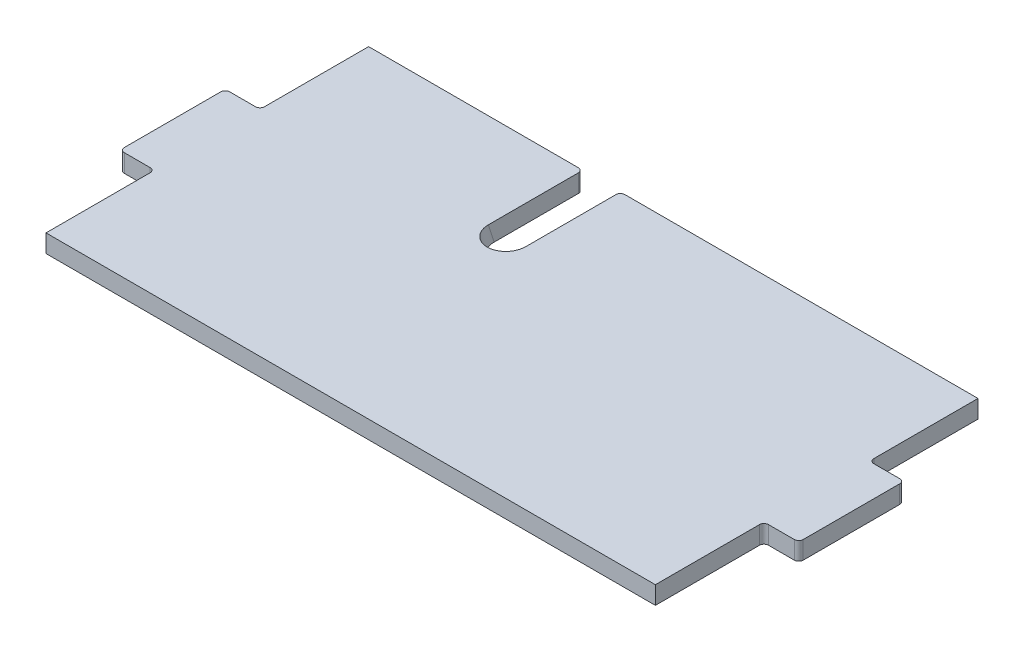
ISO-10303-21;
HEADER;
FILE_DESCRIPTION(('STEP AP214'),'2;1');
FILE_NAME('part.step','',(''),(''),'','','');
FILE_SCHEMA(('AUTOMOTIVE_DESIGN { 1 0 10303 214 1 1 1 1 }'));
ENDSEC;
DATA;
#1=APPLICATION_CONTEXT('core data for automotive mechanical design processes');
#2=APPLICATION_PROTOCOL_DEFINITION('international standard','automotive_design',2000,#1);
#3=PRODUCT_CONTEXT('',#1,'mechanical');
#4=PRODUCT('Part','Part','',(#3));
#5=PRODUCT_RELATED_PRODUCT_CATEGORY('part','',(#4));
#6=PRODUCT_DEFINITION_FORMATION('','',#4);
#7=PRODUCT_DEFINITION_CONTEXT('part definition',#1,'design');
#8=PRODUCT_DEFINITION('design','',#6,#7);
#9=PRODUCT_DEFINITION_SHAPE('','',#8);
#10=(LENGTH_UNIT() NAMED_UNIT(*) SI_UNIT(.MILLI.,.METRE.));
#11=(NAMED_UNIT(*) PLANE_ANGLE_UNIT() SI_UNIT($,.RADIAN.));
#12=(NAMED_UNIT(*) SI_UNIT($,.STERADIAN.) SOLID_ANGLE_UNIT());
#13=UNCERTAINTY_MEASURE_WITH_UNIT(LENGTH_MEASURE(1.E-05),#10,'distance_accuracy_value','');
#14=(GEOMETRIC_REPRESENTATION_CONTEXT(3) GLOBAL_UNCERTAINTY_ASSIGNED_CONTEXT((#13)) GLOBAL_UNIT_ASSIGNED_CONTEXT((#10,
#11,#12)) REPRESENTATION_CONTEXT('',''));
#15=CARTESIAN_POINT('',(0.,0.,0.));
#16=DIRECTION('',(0.,0.,1.));
#17=DIRECTION('',(1.,0.,0.));
#18=AXIS2_PLACEMENT_3D('',#15,#16,#17);
#19=CARTESIAN_POINT('',(-215.9,6.35,-88.9));
#20=DIRECTION('',(0.,0.,1.));
#21=DIRECTION('',(1.,0.,0.));
#22=AXIS2_PLACEMENT_3D('',#19,#20,#21);
#23=PLANE('',#22);
#24=DIRECTION('',(-1.,0.,0.));
#25=VECTOR('',#24,1.);
#26=CARTESIAN_POINT('',(-215.9,6.35,-88.9));
#27=LINE('',#26,#25);
#28=CARTESIAN_POINT('',(-67.3100000000009,6.35,-88.9));
#29=VERTEX_POINT('',#28);
#30=CARTESIAN_POINT('',(-215.9,6.35,-88.9));
#31=VERTEX_POINT('',#30);
#32=EDGE_CURVE('E262',#29,#31,#27,.T.);
#33=ORIENTED_EDGE('',*,*,#32,.F.);
#34=DIRECTION('',(0.,1.,0.));
#35=VECTOR('',#34,1.);
#36=CARTESIAN_POINT('',(-67.3100000000009,6.35,-88.9));
#37=LINE('',#36,#35);
#38=CARTESIAN_POINT('',(-67.3100000000009,-6.35,-88.9));
#39=VERTEX_POINT('',#38);
#40=EDGE_CURVE('E226',#29,#39,#37,.F.);
#41=ORIENTED_EDGE('',*,*,#40,.T.);
#42=DIRECTION('',(-1.,0.,0.));
#43=VECTOR('',#42,1.);
#44=CARTESIAN_POINT('',(-215.9,-6.35,-88.9));
#45=LINE('',#44,#43);
#46=CARTESIAN_POINT('',(-215.9,-6.35,-88.9));
#47=VERTEX_POINT('',#46);
#48=EDGE_CURVE('E220',#39,#47,#45,.T.);
#49=ORIENTED_EDGE('',*,*,#48,.T.);
#50=DIRECTION('',(0.,-1.,0.));
#51=VECTOR('',#50,1.);
#52=CARTESIAN_POINT('',(-215.9,6.35,-88.9));
#53=LINE('',#52,#51);
#54=EDGE_CURVE('E223',#31,#47,#53,.T.);
#55=ORIENTED_EDGE('',*,*,#54,.F.);
#56=EDGE_LOOP('',(#33,#41,#49,#55));
#57=FACE_BOUND('',#56,.T.);
#58=ADVANCED_FACE('F44',(#57),#23,.F.);
#59=CARTESIAN_POINT('',(-50.7999999999984,-226.171808135511,-98.2610939856412));
#60=DIRECTION('',(0.,0.950122861158082,0.31187585463575));
#61=DIRECTION('',(0.,0.31187585463575,-0.950122861158083));
#62=AXIS2_PLACEMENT_3D('',#59,#60,#61);
#63=CYLINDRICAL_SURFACE('',#62,13.3350000000001);
#64=CARTESIAN_POINT('',(-50.7999999999983,-6.34999999999999,-26.1050422974673));
#65=DIRECTION('',(0.,1.,0.));
#66=DIRECTION('',(0.,0.,1.));
#67=AXIS2_PLACEMENT_3D('',#64,#65,#66);
#68=ELLIPSE('',#67,14.0350269898215,13.3350000000001);
#69=CARTESIAN_POINT('',(-37.4650000000006,-6.34999999999999,-26.1050422974673));
#70=VERTEX_POINT('',#69);
#71=CARTESIAN_POINT('',(-64.1350000000009,-6.34999999999999,-26.1050422974673));
#72=VERTEX_POINT('',#71);
#73=EDGE_CURVE('E261',#70,#72,#68,.F.);
#74=ORIENTED_EDGE('',*,*,#73,.T.);
#75=DIRECTION('',(0.,0.950122861158082,0.31187585463575));
#76=VECTOR('',#75,1.);
#77=CARTESIAN_POINT('',(-64.1349999999985,-226.171808135511,-98.2610939856412));
#78=LINE('',#77,#76);
#79=CARTESIAN_POINT('',(-64.1350000000009,6.34999999999999,-21.936293690528));
#80=VERTEX_POINT('',#79);
#81=EDGE_CURVE('E249',#80,#72,#78,.F.);
#82=ORIENTED_EDGE('',*,*,#81,.F.);
#83=CARTESIAN_POINT('',(-50.7999999999983,6.34999999999999,-21.936293690528));
#84=DIRECTION('',(0.,1.,0.));
#85=DIRECTION('',(0.,0.,1.));
#86=AXIS2_PLACEMENT_3D('',#83,#84,#85);
#87=ELLIPSE('',#86,14.0350269898215,13.3350000000001);
#88=CARTESIAN_POINT('',(-37.4650000000007,6.35,-21.9362936905279));
#89=VERTEX_POINT('',#88);
#90=EDGE_CURVE('E282',#89,#80,#87,.F.);
#91=ORIENTED_EDGE('',*,*,#90,.F.);
#92=DIRECTION('',(0.,0.950122861158082,0.31187585463575));
#93=VECTOR('',#92,1.);
#94=CARTESIAN_POINT('',(-37.4649999999983,-226.171808135511,-98.2610939856413));
#95=LINE('',#94,#93);
#96=EDGE_CURVE('E327',#89,#70,#95,.F.);
#97=ORIENTED_EDGE('',*,*,#96,.T.);
#98=EDGE_LOOP('',(#74,#82,#91,#97));
#99=FACE_BOUND('',#98,.T.);
#100=ADVANCED_FACE('F502',(#99),#63,.F.);
#101=CARTESIAN_POINT('',(-215.9,6.35,-88.9));
#102=DIRECTION('',(1.,0.,0.));
#103=DIRECTION('',(0.,0.,-1.));
#104=AXIS2_PLACEMENT_3D('',#101,#102,#103);
#105=PLANE('',#104);
#106=DIRECTION('',(0.,0.,1.));
#107=VECTOR('',#106,1.);
#108=CARTESIAN_POINT('',(-215.9,-6.35,-88.9));
#109=LINE('',#108,#107);
#110=CARTESIAN_POINT('',(-215.9,-6.35,-15.113));
#111=VERTEX_POINT('',#110);
#112=EDGE_CURVE('E237',#47,#111,#109,.T.);
#113=ORIENTED_EDGE('',*,*,#112,.T.);
#114=DIRECTION('',(0.,-1.,0.));
#115=VECTOR('',#114,1.);
#116=CARTESIAN_POINT('',(-215.9,6.35,-15.113));
#117=LINE('',#116,#115);
#118=CARTESIAN_POINT('',(-215.9,6.35,-15.113));
#119=VERTEX_POINT('',#118);
#120=EDGE_CURVE('E359',#111,#119,#117,.F.);
#121=ORIENTED_EDGE('',*,*,#120,.T.);
#122=DIRECTION('',(0.,0.,1.));
#123=VECTOR('',#122,1.);
#124=CARTESIAN_POINT('',(-215.9,6.35,-88.9));
#125=LINE('',#124,#123);
#126=EDGE_CURVE('E240',#31,#119,#125,.T.);
#127=ORIENTED_EDGE('',*,*,#126,.F.);
#128=ORIENTED_EDGE('',*,*,#54,.T.);
#129=EDGE_LOOP('',(#113,#121,#127,#128));
#130=FACE_BOUND('',#129,.T.);
#131=ADVANCED_FACE('F236',(#130),#105,.F.);
#132=CARTESIAN_POINT('',(-241.3,6.35,-11.938));
#133=DIRECTION('',(0.,0.,1.));
#134=DIRECTION('',(1.,0.,0.));
#135=AXIS2_PLACEMENT_3D('',#132,#133,#134);
#136=PLANE('',#135);
#137=DIRECTION('',(-1.,0.,0.));
#138=VECTOR('',#137,1.);
#139=CARTESIAN_POINT('',(-241.3,6.35,-11.938));
#140=LINE('',#139,#138);
#141=CARTESIAN_POINT('',(-219.075,6.35,-11.938));
#142=VERTEX_POINT('',#141);
#143=CARTESIAN_POINT('',(-237.363,6.35,-11.938));
#144=VERTEX_POINT('',#143);
#145=EDGE_CURVE('E281',#142,#144,#140,.T.);
#146=ORIENTED_EDGE('',*,*,#145,.F.);
#147=DIRECTION('',(0.,-1.,0.));
#148=VECTOR('',#147,1.);
#149=CARTESIAN_POINT('',(-219.075,-6.35,-11.938));
#150=LINE('',#149,#148);
#151=CARTESIAN_POINT('',(-219.075,-6.35,-11.938));
#152=VERTEX_POINT('',#151);
#153=EDGE_CURVE('E355',#142,#152,#150,.T.);
#154=ORIENTED_EDGE('',*,*,#153,.T.);
#155=DIRECTION('',(-1.,0.,0.));
#156=VECTOR('',#155,1.);
#157=CARTESIAN_POINT('',(-241.3,-6.35,-11.938));
#158=LINE('',#157,#156);
#159=CARTESIAN_POINT('',(-237.363,-6.35,-11.938));
#160=VERTEX_POINT('',#159);
#161=EDGE_CURVE('E242',#152,#160,#158,.T.);
#162=ORIENTED_EDGE('',*,*,#161,.T.);
#163=DIRECTION('',(0.,-1.,0.));
#164=VECTOR('',#163,1.);
#165=CARTESIAN_POINT('',(-237.363,6.35,-11.938));
#166=LINE('',#165,#164);
#167=EDGE_CURVE('E339',#160,#144,#166,.F.);
#168=ORIENTED_EDGE('',*,*,#167,.T.);
#169=EDGE_LOOP('',(#146,#154,#162,#168));
#170=FACE_BOUND('',#169,.T.);
#171=ADVANCED_FACE('F547',(#170),#136,.F.);
#172=CARTESIAN_POINT('',(-240.538,6.35,-12.7));
#173=DIRECTION('',(1.,0.,0.));
#174=DIRECTION('',(0.,0.,-1.));
#175=AXIS2_PLACEMENT_3D('',#172,#173,#174);
#176=PLANE('',#175);
#177=DIRECTION('',(0.,0.,1.));
#178=VECTOR('',#177,1.);
#179=CARTESIAN_POINT('',(-240.538,6.35,-12.7));
#180=LINE('',#179,#178);
#181=CARTESIAN_POINT('',(-240.538,6.35,-8.76299999999999));
#182=VERTEX_POINT('',#181);
#183=CARTESIAN_POINT('',(-240.538,6.35,59.563));
#184=VERTEX_POINT('',#183);
#185=EDGE_CURVE('E297',#182,#184,#180,.T.);
#186=ORIENTED_EDGE('',*,*,#185,.F.);
#187=DIRECTION('',(0.,-1.,0.));
#188=VECTOR('',#187,1.);
#189=CARTESIAN_POINT('',(-240.538,6.35,-8.76299999999999));
#190=LINE('',#189,#188);
#191=CARTESIAN_POINT('',(-240.538,-6.35,-8.76299999999999));
#192=VERTEX_POINT('',#191);
#193=EDGE_CURVE('E365',#182,#192,#190,.T.);
#194=ORIENTED_EDGE('',*,*,#193,.T.);
#195=DIRECTION('',(0.,0.,1.));
#196=VECTOR('',#195,1.);
#197=CARTESIAN_POINT('',(-240.538,-6.35,-12.7));
#198=LINE('',#197,#196);
#199=CARTESIAN_POINT('',(-240.538,-6.35,59.563));
#200=VERTEX_POINT('',#199);
#201=EDGE_CURVE('E287',#192,#200,#198,.T.);
#202=ORIENTED_EDGE('',*,*,#201,.T.);
#203=DIRECTION('',(0.,-1.,0.));
#204=VECTOR('',#203,1.);
#205=CARTESIAN_POINT('',(-240.538,6.35,59.563));
#206=LINE('',#205,#204);
#207=EDGE_CURVE('E362',#200,#184,#206,.F.);
#208=ORIENTED_EDGE('',*,*,#207,.T.);
#209=EDGE_LOOP('',(#186,#194,#202,#208));
#210=FACE_BOUND('',#209,.T.);
#211=ADVANCED_FACE('F551',(#210),#176,.F.);
#212=CARTESIAN_POINT('',(-215.9,6.35,62.738));
#213=DIRECTION('',(0.,0.,-1.));
#214=DIRECTION('',(-1.,0.,0.));
#215=AXIS2_PLACEMENT_3D('',#212,#213,#214);
#216=PLANE('',#215);
#217=DIRECTION('',(1.,0.,0.));
#218=VECTOR('',#217,1.);
#219=CARTESIAN_POINT('',(-215.9,6.35,62.738));
#220=LINE('',#219,#218);
#221=CARTESIAN_POINT('',(-237.363,6.35,62.738));
#222=VERTEX_POINT('',#221);
#223=CARTESIAN_POINT('',(-219.075,6.35,62.738));
#224=VERTEX_POINT('',#223);
#225=EDGE_CURVE('E278',#222,#224,#220,.T.);
#226=ORIENTED_EDGE('',*,*,#225,.F.);
#227=DIRECTION('',(0.,-1.,0.));
#228=VECTOR('',#227,1.);
#229=CARTESIAN_POINT('',(-237.363,6.35,62.738));
#230=LINE('',#229,#228);
#231=CARTESIAN_POINT('',(-237.363,-6.35,62.738));
#232=VERTEX_POINT('',#231);
#233=EDGE_CURVE('E407',#222,#232,#230,.T.);
#234=ORIENTED_EDGE('',*,*,#233,.T.);
#235=DIRECTION('',(1.,0.,0.));
#236=VECTOR('',#235,1.);
#237=CARTESIAN_POINT('',(-215.9,-6.35,62.738));
#238=LINE('',#237,#236);
#239=CARTESIAN_POINT('',(-219.075,-6.35,62.738));
#240=VERTEX_POINT('',#239);
#241=EDGE_CURVE('E283',#232,#240,#238,.T.);
#242=ORIENTED_EDGE('',*,*,#241,.T.);
#243=DIRECTION('',(0.,-1.,0.));
#244=VECTOR('',#243,1.);
#245=CARTESIAN_POINT('',(-219.075,6.35,62.738));
#246=LINE('',#245,#244);
#247=EDGE_CURVE('E404',#240,#224,#246,.F.);
#248=ORIENTED_EDGE('',*,*,#247,.T.);
#249=EDGE_LOOP('',(#226,#234,#242,#248));
#250=FACE_BOUND('',#249,.T.);
#251=ADVANCED_FACE('F544',(#250),#216,.F.);
#252=CARTESIAN_POINT('',(-215.9,6.35,63.5));
#253=DIRECTION('',(1.,0.,0.));
#254=DIRECTION('',(0.,0.,-1.));
#255=AXIS2_PLACEMENT_3D('',#252,#253,#254);
#256=PLANE('',#255);
#257=DIRECTION('',(0.,0.,1.));
#258=VECTOR('',#257,1.);
#259=CARTESIAN_POINT('',(-215.9,6.35,63.5));
#260=LINE('',#259,#258);
#261=CARTESIAN_POINT('',(-215.9,6.35,65.913));
#262=VERTEX_POINT('',#261);
#263=CARTESIAN_POINT('',(-215.9,6.35,139.7));
#264=VERTEX_POINT('',#263);
#265=EDGE_CURVE('E275',#262,#264,#260,.T.);
#266=ORIENTED_EDGE('',*,*,#265,.F.);
#267=DIRECTION('',(0.,-1.,0.));
#268=VECTOR('',#267,1.);
#269=CARTESIAN_POINT('',(-215.9,-6.35,65.913));
#270=LINE('',#269,#268);
#271=CARTESIAN_POINT('',(-215.9,-6.35,65.913));
#272=VERTEX_POINT('',#271);
#273=EDGE_CURVE('E411',#262,#272,#270,.T.);
#274=ORIENTED_EDGE('',*,*,#273,.T.);
#275=DIRECTION('',(0.,0.,1.));
#276=VECTOR('',#275,1.);
#277=CARTESIAN_POINT('',(-215.9,-6.35,63.5));
#278=LINE('',#277,#276);
#279=CARTESIAN_POINT('',(-215.9,-6.35,139.7));
#280=VERTEX_POINT('',#279);
#281=EDGE_CURVE('E256',#272,#280,#278,.T.);
#282=ORIENTED_EDGE('',*,*,#281,.T.);
#283=DIRECTION('',(0.,-1.,0.));
#284=VECTOR('',#283,1.);
#285=CARTESIAN_POINT('',(-215.9,6.35,139.7));
#286=LINE('',#285,#284);
#287=EDGE_CURVE('E839',#264,#280,#286,.T.);
#288=ORIENTED_EDGE('',*,*,#287,.F.);
#289=EDGE_LOOP('',(#266,#274,#282,#288));
#290=FACE_BOUND('',#289,.T.);
#291=ADVANCED_FACE('F540',(#290),#256,.F.);
#292=CARTESIAN_POINT('',(-215.9,6.35,139.7));
#293=DIRECTION('',(0.,0.,-1.));
#294=DIRECTION('',(-1.,0.,0.));
#295=AXIS2_PLACEMENT_3D('',#292,#293,#294);
#296=PLANE('',#295);
#297=DIRECTION('',(1.,0.,0.));
#298=VECTOR('',#297,1.);
#299=CARTESIAN_POINT('',(-215.9,-6.35,139.7));
#300=LINE('',#299,#298);
#301=CARTESIAN_POINT('',(215.9,-6.35,139.7));
#302=VERTEX_POINT('',#301);
#303=EDGE_CURVE('E843',#280,#302,#300,.T.);
#304=ORIENTED_EDGE('',*,*,#303,.T.);
#305=DIRECTION('',(0.,-1.,0.));
#306=VECTOR('',#305,1.);
#307=CARTESIAN_POINT('',(215.9,6.35,139.7));
#308=LINE('',#307,#306);
#309=CARTESIAN_POINT('',(215.9,6.35,139.7));
#310=VERTEX_POINT('',#309);
#311=EDGE_CURVE('E309',#310,#302,#308,.T.);
#312=ORIENTED_EDGE('',*,*,#311,.F.);
#313=DIRECTION('',(1.,0.,0.));
#314=VECTOR('',#313,1.);
#315=CARTESIAN_POINT('',(-215.9,6.35,139.7));
#316=LINE('',#315,#314);
#317=EDGE_CURVE('E272',#264,#310,#316,.T.);
#318=ORIENTED_EDGE('',*,*,#317,.F.);
#319=ORIENTED_EDGE('',*,*,#287,.T.);
#320=EDGE_LOOP('',(#304,#312,#318,#319));
#321=FACE_BOUND('',#320,.T.);
#322=ADVANCED_FACE('F536',(#321),#296,.F.);
#323=CARTESIAN_POINT('',(215.9,6.35,63.5));
#324=DIRECTION('',(-1.,0.,0.));
#325=DIRECTION('',(0.,0.,1.));
#326=AXIS2_PLACEMENT_3D('',#323,#324,#325);
#327=PLANE('',#326);
#328=DIRECTION('',(0.,0.,-1.));
#329=VECTOR('',#328,1.);
#330=CARTESIAN_POINT('',(215.9,-6.35,63.5));
#331=LINE('',#330,#329);
#332=CARTESIAN_POINT('',(215.9,-6.35,65.913));
#333=VERTEX_POINT('',#332);
#334=EDGE_CURVE('E835',#302,#333,#331,.T.);
#335=ORIENTED_EDGE('',*,*,#334,.T.);
#336=DIRECTION('',(0.,-1.,0.));
#337=VECTOR('',#336,1.);
#338=CARTESIAN_POINT('',(215.9,6.35,65.913));
#339=LINE('',#338,#337);
#340=CARTESIAN_POINT('',(215.9,6.35,65.913));
#341=VERTEX_POINT('',#340);
#342=EDGE_CURVE('E422',#333,#341,#339,.F.);
#343=ORIENTED_EDGE('',*,*,#342,.T.);
#344=DIRECTION('',(0.,0.,-1.));
#345=VECTOR('',#344,1.);
#346=CARTESIAN_POINT('',(215.9,6.35,63.5));
#347=LINE('',#346,#345);
#348=EDGE_CURVE('E267',#310,#341,#347,.T.);
#349=ORIENTED_EDGE('',*,*,#348,.F.);
#350=ORIENTED_EDGE('',*,*,#311,.T.);
#351=EDGE_LOOP('',(#335,#343,#349,#350));
#352=FACE_BOUND('',#351,.T.);
#353=ADVANCED_FACE('F532',(#352),#327,.F.);
#354=CARTESIAN_POINT('',(215.9,6.35,62.738));
#355=DIRECTION('',(0.,0.,-1.));
#356=DIRECTION('',(-1.,0.,0.));
#357=AXIS2_PLACEMENT_3D('',#354,#355,#356);
#358=PLANE('',#357);
#359=DIRECTION('',(1.,0.,0.));
#360=VECTOR('',#359,1.);
#361=CARTESIAN_POINT('',(215.9,6.35,62.738));
#362=LINE('',#361,#360);
#363=CARTESIAN_POINT('',(219.075,6.35,62.738));
#364=VERTEX_POINT('',#363);
#365=CARTESIAN_POINT('',(237.363,6.35,62.738));
#366=VERTEX_POINT('',#365);
#367=EDGE_CURVE('E271',#364,#366,#362,.T.);
#368=ORIENTED_EDGE('',*,*,#367,.F.);
#369=DIRECTION('',(0.,-1.,0.));
#370=VECTOR('',#369,1.);
#371=CARTESIAN_POINT('',(219.075,-6.35,62.738));
#372=LINE('',#371,#370);
#373=CARTESIAN_POINT('',(219.075,-6.35,62.738));
#374=VERTEX_POINT('',#373);
#375=EDGE_CURVE('E418',#364,#374,#372,.T.);
#376=ORIENTED_EDGE('',*,*,#375,.T.);
#377=DIRECTION('',(1.,0.,0.));
#378=VECTOR('',#377,1.);
#379=CARTESIAN_POINT('',(215.9,-6.35,62.738));
#380=LINE('',#379,#378);
#381=CARTESIAN_POINT('',(237.363,-6.35,62.738));
#382=VERTEX_POINT('',#381);
#383=EDGE_CURVE('E304',#374,#382,#380,.T.);
#384=ORIENTED_EDGE('',*,*,#383,.T.);
#385=DIRECTION('',(0.,-1.,0.));
#386=VECTOR('',#385,1.);
#387=CARTESIAN_POINT('',(237.363,6.35,62.738));
#388=LINE('',#387,#386);
#389=EDGE_CURVE('E415',#382,#366,#388,.F.);
#390=ORIENTED_EDGE('',*,*,#389,.T.);
#391=EDGE_LOOP('',(#368,#376,#384,#390));
#392=FACE_BOUND('',#391,.T.);
#393=ADVANCED_FACE('F535',(#392),#358,.F.);
#394=CARTESIAN_POINT('',(240.538,6.35,-12.7));
#395=DIRECTION('',(-1.,0.,0.));
#396=DIRECTION('',(0.,0.,1.));
#397=AXIS2_PLACEMENT_3D('',#394,#395,#396);
#398=PLANE('',#397);
#399=DIRECTION('',(0.,0.,-1.));
#400=VECTOR('',#399,1.);
#401=CARTESIAN_POINT('',(240.538,6.35,-12.7));
#402=LINE('',#401,#400);
#403=CARTESIAN_POINT('',(240.538,6.35,59.563));
#404=VERTEX_POINT('',#403);
#405=CARTESIAN_POINT('',(240.538,6.35,-8.76299999999999));
#406=VERTEX_POINT('',#405);
#407=EDGE_CURVE('E313',#404,#406,#402,.T.);
#408=ORIENTED_EDGE('',*,*,#407,.F.);
#409=DIRECTION('',(0.,-1.,0.));
#410=VECTOR('',#409,1.);
#411=CARTESIAN_POINT('',(240.538,6.35,59.563));
#412=LINE('',#411,#410);
#413=CARTESIAN_POINT('',(240.538,-6.35,59.563));
#414=VERTEX_POINT('',#413);
#415=EDGE_CURVE('E428',#404,#414,#412,.T.);
#416=ORIENTED_EDGE('',*,*,#415,.T.);
#417=DIRECTION('',(0.,0.,-1.));
#418=VECTOR('',#417,1.);
#419=CARTESIAN_POINT('',(240.538,-6.35,-12.7));
#420=LINE('',#419,#418);
#421=CARTESIAN_POINT('',(240.538,-6.35,-8.76299999999999));
#422=VERTEX_POINT('',#421);
#423=EDGE_CURVE('E308',#414,#422,#420,.T.);
#424=ORIENTED_EDGE('',*,*,#423,.T.);
#425=DIRECTION('',(0.,-1.,0.));
#426=VECTOR('',#425,1.);
#427=CARTESIAN_POINT('',(240.538,6.35,-8.76299999999999));
#428=LINE('',#427,#426);
#429=EDGE_CURVE('E425',#422,#406,#428,.F.);
#430=ORIENTED_EDGE('',*,*,#429,.T.);
#431=EDGE_LOOP('',(#408,#416,#424,#430));
#432=FACE_BOUND('',#431,.T.);
#433=ADVANCED_FACE('F529',(#432),#398,.F.);
#434=CARTESIAN_POINT('',(241.3,6.35,-11.938));
#435=DIRECTION('',(0.,0.,1.));
#436=DIRECTION('',(1.,0.,0.));
#437=AXIS2_PLACEMENT_3D('',#434,#435,#436);
#438=PLANE('',#437);
#439=DIRECTION('',(-1.,0.,0.));
#440=VECTOR('',#439,1.);
#441=CARTESIAN_POINT('',(241.3,6.35,-11.938));
#442=LINE('',#441,#440);
#443=CARTESIAN_POINT('',(237.363,6.35,-11.938));
#444=VERTEX_POINT('',#443);
#445=CARTESIAN_POINT('',(219.075,6.35,-11.938));
#446=VERTEX_POINT('',#445);
#447=EDGE_CURVE('E266',#444,#446,#442,.T.);
#448=ORIENTED_EDGE('',*,*,#447,.F.);
#449=DIRECTION('',(0.,-1.,0.));
#450=VECTOR('',#449,1.);
#451=CARTESIAN_POINT('',(237.363,6.35,-11.938));
#452=LINE('',#451,#450);
#453=CARTESIAN_POINT('',(237.363,-6.35,-11.938));
#454=VERTEX_POINT('',#453);
#455=EDGE_CURVE('E435',#444,#454,#452,.T.);
#456=ORIENTED_EDGE('',*,*,#455,.T.);
#457=DIRECTION('',(-1.,0.,0.));
#458=VECTOR('',#457,1.);
#459=CARTESIAN_POINT('',(241.3,-6.35,-11.938));
#460=LINE('',#459,#458);
#461=CARTESIAN_POINT('',(219.075,-6.35,-11.938));
#462=VERTEX_POINT('',#461);
#463=EDGE_CURVE('E320',#454,#462,#460,.T.);
#464=ORIENTED_EDGE('',*,*,#463,.T.);
#465=DIRECTION('',(0.,-1.,0.));
#466=VECTOR('',#465,1.);
#467=CARTESIAN_POINT('',(219.075,6.35,-11.938));
#468=LINE('',#467,#466);
#469=EDGE_CURVE('E432',#462,#446,#468,.F.);
#470=ORIENTED_EDGE('',*,*,#469,.T.);
#471=EDGE_LOOP('',(#448,#456,#464,#470));
#472=FACE_BOUND('',#471,.T.);
#473=ADVANCED_FACE('F480',(#472),#438,.F.);
#474=CARTESIAN_POINT('',(215.9,6.35,-88.9));
#475=DIRECTION('',(-1.,0.,0.));
#476=DIRECTION('',(0.,0.,1.));
#477=AXIS2_PLACEMENT_3D('',#474,#475,#476);
#478=PLANE('',#477);
#479=DIRECTION('',(0.,0.,-1.));
#480=VECTOR('',#479,1.);
#481=CARTESIAN_POINT('',(215.9,6.35,-88.9));
#482=LINE('',#481,#480);
#483=CARTESIAN_POINT('',(215.9,6.35,-15.113));
#484=VERTEX_POINT('',#483);
#485=CARTESIAN_POINT('',(215.9,6.35,-88.9));
#486=VERTEX_POINT('',#485);
#487=EDGE_CURVE('E263',#484,#486,#482,.T.);
#488=ORIENTED_EDGE('',*,*,#487,.F.);
#489=DIRECTION('',(0.,-1.,0.));
#490=VECTOR('',#489,1.);
#491=CARTESIAN_POINT('',(215.9,-6.35,-15.113));
#492=LINE('',#491,#490);
#493=CARTESIAN_POINT('',(215.9,-6.35,-15.113));
#494=VERTEX_POINT('',#493);
#495=EDGE_CURVE('E439',#484,#494,#492,.T.);
#496=ORIENTED_EDGE('',*,*,#495,.T.);
#497=DIRECTION('',(0.,0.,-1.));
#498=VECTOR('',#497,1.);
#499=CARTESIAN_POINT('',(215.9,-6.35,-88.9));
#500=LINE('',#499,#498);
#501=CARTESIAN_POINT('',(215.9,-6.35,-88.9));
#502=VERTEX_POINT('',#501);
#503=EDGE_CURVE('E232',#494,#502,#500,.T.);
#504=ORIENTED_EDGE('',*,*,#503,.T.);
#505=DIRECTION('',(0.,-1.,0.));
#506=VECTOR('',#505,1.);
#507=CARTESIAN_POINT('',(215.9,6.35,-88.9));
#508=LINE('',#507,#506);
#509=EDGE_CURVE('E349',#486,#502,#508,.T.);
#510=ORIENTED_EDGE('',*,*,#509,.F.);
#511=EDGE_LOOP('',(#488,#496,#504,#510));
#512=FACE_BOUND('',#511,.T.);
#513=ADVANCED_FACE('F488',(#512),#478,.F.);
#514=CARTESIAN_POINT('',(-34.2900000000007,-6.35,-88.9));
#515=VERTEX_POINT('',#514);
#516=EDGE_CURVE('E231',#502,#515,#45,.T.);
#517=ORIENTED_EDGE('',*,*,#516,.T.);
#518=DIRECTION('',(0.,-1.,0.));
#519=VECTOR('',#518,1.);
#520=CARTESIAN_POINT('',(-34.2900000000007,6.35000000000089,-88.9));
#521=LINE('',#520,#519);
#522=CARTESIAN_POINT('',(-34.2900000000007,6.35,-88.9));
#523=VERTEX_POINT('',#522);
#524=EDGE_CURVE('E68',#515,#523,#521,.F.);
#525=ORIENTED_EDGE('',*,*,#524,.T.);
#526=EDGE_CURVE('E258',#486,#523,#27,.T.);
#527=ORIENTED_EDGE('',*,*,#526,.F.);
#528=ORIENTED_EDGE('',*,*,#509,.T.);
#529=EDGE_LOOP('',(#517,#525,#527,#528));
#530=FACE_BOUND('',#529,.T.);
#531=ADVANCED_FACE('F492',(#530),#23,.F.);
#532=CARTESIAN_POINT('',(0.,6.35,0.));
#533=DIRECTION('',(0.,1.,0.));
#534=DIRECTION('',(0.,0.,1.));
#535=AXIS2_PLACEMENT_3D('',#532,#533,#534);
#536=PLANE('',#535);
#537=ORIENTED_EDGE('',*,*,#145,.T.);
#538=CARTESIAN_POINT('',(-237.363,6.35,-8.76299999999999));
#539=DIRECTION('',(0.,1.,0.));
#540=DIRECTION('',(0.,0.,1.));
#541=AXIS2_PLACEMENT_3D('',#538,#539,#540);
#542=CIRCLE('',#541,3.175);
#543=EDGE_CURVE('E401',#144,#182,#542,.T.);
#544=ORIENTED_EDGE('',*,*,#543,.T.);
#545=ORIENTED_EDGE('',*,*,#185,.T.);
#546=CARTESIAN_POINT('',(-237.363,6.35,59.563));
#547=DIRECTION('',(0.,1.,0.));
#548=DIRECTION('',(0.,0.,1.));
#549=AXIS2_PLACEMENT_3D('',#546,#547,#548);
#550=CIRCLE('',#549,3.175);
#551=EDGE_CURVE('E398',#184,#222,#550,.T.);
#552=ORIENTED_EDGE('',*,*,#551,.T.);
#553=ORIENTED_EDGE('',*,*,#225,.T.);
#554=CARTESIAN_POINT('',(-219.075,6.35,65.913));
#555=DIRECTION('',(0.,1.,0.));
#556=DIRECTION('',(0.,0.,1.));
#557=AXIS2_PLACEMENT_3D('',#554,#555,#556);
#558=CIRCLE('',#557,3.175);
#559=EDGE_CURVE('E463',#224,#262,#558,.F.);
#560=ORIENTED_EDGE('',*,*,#559,.T.);
#561=ORIENTED_EDGE('',*,*,#265,.T.);
#562=ORIENTED_EDGE('',*,*,#317,.T.);
#563=ORIENTED_EDGE('',*,*,#348,.T.);
#564=CARTESIAN_POINT('',(219.075,6.35,65.913));
#565=DIRECTION('',(0.,1.,0.));
#566=DIRECTION('',(0.,0.,1.));
#567=AXIS2_PLACEMENT_3D('',#564,#565,#566);
#568=CIRCLE('',#567,3.175);
#569=EDGE_CURVE('E469',#341,#364,#568,.F.);
#570=ORIENTED_EDGE('',*,*,#569,.T.);
#571=ORIENTED_EDGE('',*,*,#367,.T.);
#572=CARTESIAN_POINT('',(237.363,6.35,59.563));
#573=DIRECTION('',(0.,1.,0.));
#574=DIRECTION('',(0.,0.,1.));
#575=AXIS2_PLACEMENT_3D('',#572,#573,#574);
#576=CIRCLE('',#575,3.175);
#577=EDGE_CURVE('E395',#366,#404,#576,.T.);
#578=ORIENTED_EDGE('',*,*,#577,.T.);
#579=ORIENTED_EDGE('',*,*,#407,.T.);
#580=CARTESIAN_POINT('',(237.363,6.35,-8.76299999999999));
#581=DIRECTION('',(0.,1.,0.));
#582=DIRECTION('',(0.,0.,1.));
#583=AXIS2_PLACEMENT_3D('',#580,#581,#582);
#584=CIRCLE('',#583,3.175);
#585=EDGE_CURVE('E392',#406,#444,#584,.T.);
#586=ORIENTED_EDGE('',*,*,#585,.T.);
#587=ORIENTED_EDGE('',*,*,#447,.T.);
#588=CARTESIAN_POINT('',(219.075,6.35,-15.113));
#589=DIRECTION('',(0.,1.,0.));
#590=DIRECTION('',(0.,0.,1.));
#591=AXIS2_PLACEMENT_3D('',#588,#589,#590);
#592=CIRCLE('',#591,3.175);
#593=EDGE_CURVE('E12',#446,#484,#592,.F.);
#594=ORIENTED_EDGE('',*,*,#593,.T.);
#595=ORIENTED_EDGE('',*,*,#487,.T.);
#596=ORIENTED_EDGE('',*,*,#526,.T.);
#597=CARTESIAN_POINT('',(-34.2900000000007,6.35,-85.725));
#598=DIRECTION('',(0.,1.,0.));
#599=DIRECTION('',(0.,0.,1.));
#600=AXIS2_PLACEMENT_3D('',#597,#598,#599);
#601=CIRCLE('',#600,3.175);
#602=CARTESIAN_POINT('',(-37.4650000000007,6.35,-85.725));
#603=VERTEX_POINT('',#602);
#604=EDGE_CURVE('E60',#523,#603,#601,.T.);
#605=ORIENTED_EDGE('',*,*,#604,.T.);
#606=DIRECTION('',(0.,0.,-1.));
#607=VECTOR('',#606,1.);
#608=CARTESIAN_POINT('',(-37.4650000000007,6.35,0.));
#609=LINE('',#608,#607);
#610=EDGE_CURVE('E343',#89,#603,#609,.T.);
#611=ORIENTED_EDGE('',*,*,#610,.F.);
#612=ORIENTED_EDGE('',*,*,#90,.T.);
#613=DIRECTION('',(0.,0.,-1.));
#614=VECTOR('',#613,1.);
#615=CARTESIAN_POINT('',(-64.1350000000009,6.35,139.701));
#616=LINE('',#615,#614);
#617=CARTESIAN_POINT('',(-64.1350000000009,6.35,-85.725));
#618=VERTEX_POINT('',#617);
#619=EDGE_CURVE('E335',#80,#618,#616,.T.);
#620=ORIENTED_EDGE('',*,*,#619,.T.);
#621=CARTESIAN_POINT('',(-67.3100000000009,6.35,-85.725));
#622=DIRECTION('',(0.,1.,0.));
#623=DIRECTION('',(0.,0.,1.));
#624=AXIS2_PLACEMENT_3D('',#621,#622,#623);
#625=CIRCLE('',#624,3.175);
#626=EDGE_CURVE('E387',#618,#29,#625,.T.);
#627=ORIENTED_EDGE('',*,*,#626,.T.);
#628=ORIENTED_EDGE('',*,*,#32,.T.);
#629=ORIENTED_EDGE('',*,*,#126,.T.);
#630=CARTESIAN_POINT('',(-219.075,6.35,-15.113));
#631=DIRECTION('',(0.,1.,0.));
#632=DIRECTION('',(0.,0.,1.));
#633=AXIS2_PLACEMENT_3D('',#630,#631,#632);
#634=CIRCLE('',#633,3.175);
#635=EDGE_CURVE('E457',#119,#142,#634,.F.);
#636=ORIENTED_EDGE('',*,*,#635,.T.);
#637=EDGE_LOOP('',(#537,#544,#545,#552,#553,#560,#561,#562,#563,#570,#571,#578,#579,#586,#587,
#594,#595,#596,#605,#611,#612,#620,#627,#628,#629,#636));
#638=FACE_BOUND('',#637,.T.);
#639=ADVANCED_FACE('F485',(#638),#536,.T.);
#640=CARTESIAN_POINT('',(0.,-6.35,0.));
#641=DIRECTION('',(0.,1.,0.));
#642=DIRECTION('',(0.,0.,1.));
#643=AXIS2_PLACEMENT_3D('',#640,#641,#642);
#644=PLANE('',#643);
#645=ORIENTED_EDGE('',*,*,#201,.F.);
#646=CARTESIAN_POINT('',(-237.363,-6.35,-8.76299999999999));
#647=DIRECTION('',(0.,1.,0.));
#648=DIRECTION('',(0.,0.,1.));
#649=AXIS2_PLACEMENT_3D('',#646,#647,#648);
#650=CIRCLE('',#649,3.175);
#651=EDGE_CURVE('E384',#192,#160,#650,.F.);
#652=ORIENTED_EDGE('',*,*,#651,.T.);
#653=ORIENTED_EDGE('',*,*,#161,.F.);
#654=CARTESIAN_POINT('',(-219.075,-6.35,-15.113));
#655=DIRECTION('',(0.,1.,0.));
#656=DIRECTION('',(0.,0.,1.));
#657=AXIS2_PLACEMENT_3D('',#654,#655,#656);
#658=CIRCLE('',#657,3.175);
#659=EDGE_CURVE('E247',#152,#111,#658,.T.);
#660=ORIENTED_EDGE('',*,*,#659,.T.);
#661=ORIENTED_EDGE('',*,*,#112,.F.);
#662=ORIENTED_EDGE('',*,*,#48,.F.);
#663=CARTESIAN_POINT('',(-67.3100000000009,-6.35,-85.725));
#664=DIRECTION('',(0.,1.,0.));
#665=DIRECTION('',(0.,0.,1.));
#666=AXIS2_PLACEMENT_3D('',#663,#664,#665);
#667=CIRCLE('',#666,3.175);
#668=CARTESIAN_POINT('',(-64.1350000000009,-6.35,-85.725));
#669=VERTEX_POINT('',#668);
#670=EDGE_CURVE('E369',#39,#669,#667,.F.);
#671=ORIENTED_EDGE('',*,*,#670,.T.);
#672=DIRECTION('',(0.,0.,-1.));
#673=VECTOR('',#672,1.);
#674=CARTESIAN_POINT('',(-64.1350000000009,-6.35,139.701));
#675=LINE('',#674,#673);
#676=EDGE_CURVE('E331',#72,#669,#675,.T.);
#677=ORIENTED_EDGE('',*,*,#676,.F.);
#678=ORIENTED_EDGE('',*,*,#73,.F.);
#679=DIRECTION('',(0.,0.,-1.));
#680=VECTOR('',#679,1.);
#681=CARTESIAN_POINT('',(-37.4650000000006,-6.35,0.));
#682=LINE('',#681,#680);
#683=CARTESIAN_POINT('',(-37.4650000000006,-6.35,-85.725));
#684=VERTEX_POINT('',#683);
#685=EDGE_CURVE('E252',#70,#684,#682,.T.);
#686=ORIENTED_EDGE('',*,*,#685,.T.);
#687=CARTESIAN_POINT('',(-34.2900000000006,-6.35,-85.725));
#688=DIRECTION('',(0.,1.,0.));
#689=DIRECTION('',(0.,0.,1.));
#690=AXIS2_PLACEMENT_3D('',#687,#688,#689);
#691=CIRCLE('',#690,3.175);
#692=EDGE_CURVE('E372',#684,#515,#691,.F.);
#693=ORIENTED_EDGE('',*,*,#692,.T.);
#694=ORIENTED_EDGE('',*,*,#516,.F.);
#695=ORIENTED_EDGE('',*,*,#503,.F.);
#696=CARTESIAN_POINT('',(219.075,-6.35,-15.113));
#697=DIRECTION('',(0.,1.,0.));
#698=DIRECTION('',(0.,0.,1.));
#699=AXIS2_PLACEMENT_3D('',#696,#697,#698);
#700=CIRCLE('',#699,3.175);
#701=EDGE_CURVE('E53',#494,#462,#700,.T.);
#702=ORIENTED_EDGE('',*,*,#701,.T.);
#703=ORIENTED_EDGE('',*,*,#463,.F.);
#704=CARTESIAN_POINT('',(237.363,-6.35,-8.76299999999999));
#705=DIRECTION('',(0.,1.,0.));
#706=DIRECTION('',(0.,0.,1.));
#707=AXIS2_PLACEMENT_3D('',#704,#705,#706);
#708=CIRCLE('',#707,3.175);
#709=EDGE_CURVE('E375',#454,#422,#708,.F.);
#710=ORIENTED_EDGE('',*,*,#709,.T.);
#711=ORIENTED_EDGE('',*,*,#423,.F.);
#712=CARTESIAN_POINT('',(237.363,-6.35,59.563));
#713=DIRECTION('',(0.,1.,0.));
#714=DIRECTION('',(0.,0.,1.));
#715=AXIS2_PLACEMENT_3D('',#712,#713,#714);
#716=CIRCLE('',#715,3.175);
#717=EDGE_CURVE('E378',#414,#382,#716,.F.);
#718=ORIENTED_EDGE('',*,*,#717,.T.);
#719=ORIENTED_EDGE('',*,*,#383,.F.);
#720=CARTESIAN_POINT('',(219.075,-6.35,65.913));
#721=DIRECTION('',(0.,1.,0.));
#722=DIRECTION('',(0.,0.,1.));
#723=AXIS2_PLACEMENT_3D('',#720,#721,#722);
#724=CIRCLE('',#723,3.175);
#725=EDGE_CURVE('E466',#374,#333,#724,.T.);
#726=ORIENTED_EDGE('',*,*,#725,.T.);
#727=ORIENTED_EDGE('',*,*,#334,.F.);
#728=ORIENTED_EDGE('',*,*,#303,.F.);
#729=ORIENTED_EDGE('',*,*,#281,.F.);
#730=CARTESIAN_POINT('',(-219.075,-6.35,65.913));
#731=DIRECTION('',(0.,1.,0.));
#732=DIRECTION('',(0.,0.,1.));
#733=AXIS2_PLACEMENT_3D('',#730,#731,#732);
#734=CIRCLE('',#733,3.175);
#735=EDGE_CURVE('E460',#272,#240,#734,.T.);
#736=ORIENTED_EDGE('',*,*,#735,.T.);
#737=ORIENTED_EDGE('',*,*,#241,.F.);
#738=CARTESIAN_POINT('',(-237.363,-6.35,59.563));
#739=DIRECTION('',(0.,1.,0.));
#740=DIRECTION('',(0.,0.,1.));
#741=AXIS2_PLACEMENT_3D('',#738,#739,#740);
#742=CIRCLE('',#741,3.175);
#743=EDGE_CURVE('E381',#232,#200,#742,.F.);
#744=ORIENTED_EDGE('',*,*,#743,.T.);
#745=EDGE_LOOP('',(#645,#652,#653,#660,#661,#662,#671,#677,#678,#686,#693,#694,#695,#702,#703,
#710,#711,#718,#719,#726,#727,#728,#729,#736,#737,#744));
#746=FACE_BOUND('',#745,.T.);
#747=ADVANCED_FACE('F245',(#746),#644,.F.);
#748=CARTESIAN_POINT('',(-37.4650000000006,-6.35,139.701));
#749=DIRECTION('',(1.,0.,0.));
#750=DIRECTION('',(0.,1.,0.));
#751=AXIS2_PLACEMENT_3D('',#748,#749,#750);
#752=PLANE('',#751);
#753=ORIENTED_EDGE('',*,*,#610,.T.);
#754=DIRECTION('',(0.,-1.,0.));
#755=VECTOR('',#754,1.);
#756=CARTESIAN_POINT('',(-37.4650000000006,-6.35,-85.725));
#757=LINE('',#756,#755);
#758=EDGE_CURVE('E443',#603,#684,#757,.T.);
#759=ORIENTED_EDGE('',*,*,#758,.T.);
#760=ORIENTED_EDGE('',*,*,#685,.F.);
#761=ORIENTED_EDGE('',*,*,#96,.F.);
#762=EDGE_LOOP('',(#753,#759,#760,#761));
#763=FACE_BOUND('',#762,.T.);
#764=ADVANCED_FACE('F497',(#763),#752,.F.);
#765=CARTESIAN_POINT('',(-64.1350000000009,6.34999999999999,139.701));
#766=DIRECTION('',(-1.,0.,0.));
#767=DIRECTION('',(0.,0.,1.));
#768=AXIS2_PLACEMENT_3D('',#765,#766,#767);
#769=PLANE('',#768);
#770=ORIENTED_EDGE('',*,*,#676,.T.);
#771=DIRECTION('',(0.,1.,0.));
#772=VECTOR('',#771,1.);
#773=CARTESIAN_POINT('',(-64.1350000000009,6.34999999999999,-85.725));
#774=LINE('',#773,#772);
#775=EDGE_CURVE('E449',#669,#618,#774,.T.);
#776=ORIENTED_EDGE('',*,*,#775,.T.);
#777=ORIENTED_EDGE('',*,*,#619,.F.);
#778=ORIENTED_EDGE('',*,*,#81,.T.);
#779=EDGE_LOOP('',(#770,#776,#777,#778));
#780=FACE_BOUND('',#779,.T.);
#781=ADVANCED_FACE('F505',(#780),#769,.F.);
#782=CARTESIAN_POINT('',(-219.075,6.35,-15.113));
#783=DIRECTION('',(0.,1.,0.));
#784=DIRECTION('',(0.,0.,1.));
#785=AXIS2_PLACEMENT_3D('',#782,#783,#784);
#786=CYLINDRICAL_SURFACE('',#785,3.175);
#787=ORIENTED_EDGE('',*,*,#635,.F.);
#788=ORIENTED_EDGE('',*,*,#120,.F.);
#789=ORIENTED_EDGE('',*,*,#659,.F.);
#790=ORIENTED_EDGE('',*,*,#153,.F.);
#791=EDGE_LOOP('',(#787,#788,#789,#790));
#792=FACE_BOUND('',#791,.T.);
#793=ADVANCED_FACE('F569',(#792),#786,.F.);
#794=CARTESIAN_POINT('',(-237.363,6.35,-8.76299999999999));
#795=DIRECTION('',(0.,-1.,0.));
#796=DIRECTION('',(0.,0.,-1.));
#797=AXIS2_PLACEMENT_3D('',#794,#795,#796);
#798=CYLINDRICAL_SURFACE('',#797,3.175);
#799=ORIENTED_EDGE('',*,*,#543,.F.);
#800=ORIENTED_EDGE('',*,*,#167,.F.);
#801=ORIENTED_EDGE('',*,*,#651,.F.);
#802=ORIENTED_EDGE('',*,*,#193,.F.);
#803=EDGE_LOOP('',(#799,#800,#801,#802));
#804=FACE_BOUND('',#803,.T.);
#805=ADVANCED_FACE('F575',(#804),#798,.T.);
#806=CARTESIAN_POINT('',(-237.363,6.35,59.563));
#807=DIRECTION('',(0.,-1.,0.));
#808=DIRECTION('',(0.,0.,-1.));
#809=AXIS2_PLACEMENT_3D('',#806,#807,#808);
#810=CYLINDRICAL_SURFACE('',#809,3.175);
#811=ORIENTED_EDGE('',*,*,#551,.F.);
#812=ORIENTED_EDGE('',*,*,#207,.F.);
#813=ORIENTED_EDGE('',*,*,#743,.F.);
#814=ORIENTED_EDGE('',*,*,#233,.F.);
#815=EDGE_LOOP('',(#811,#812,#813,#814));
#816=FACE_BOUND('',#815,.T.);
#817=ADVANCED_FACE('F579',(#816),#810,.T.);
#818=CARTESIAN_POINT('',(-219.075,6.35,65.913));
#819=DIRECTION('',(0.,1.,0.));
#820=DIRECTION('',(0.,0.,1.));
#821=AXIS2_PLACEMENT_3D('',#818,#819,#820);
#822=CYLINDRICAL_SURFACE('',#821,3.175);
#823=ORIENTED_EDGE('',*,*,#559,.F.);
#824=ORIENTED_EDGE('',*,*,#247,.F.);
#825=ORIENTED_EDGE('',*,*,#735,.F.);
#826=ORIENTED_EDGE('',*,*,#273,.F.);
#827=EDGE_LOOP('',(#823,#824,#825,#826));
#828=FACE_BOUND('',#827,.T.);
#829=ADVANCED_FACE('F583',(#828),#822,.F.);
#830=CARTESIAN_POINT('',(219.075,6.35,65.913));
#831=DIRECTION('',(0.,1.,0.));
#832=DIRECTION('',(0.,0.,1.));
#833=AXIS2_PLACEMENT_3D('',#830,#831,#832);
#834=CYLINDRICAL_SURFACE('',#833,3.175);
#835=ORIENTED_EDGE('',*,*,#569,.F.);
#836=ORIENTED_EDGE('',*,*,#342,.F.);
#837=ORIENTED_EDGE('',*,*,#725,.F.);
#838=ORIENTED_EDGE('',*,*,#375,.F.);
#839=EDGE_LOOP('',(#835,#836,#837,#838));
#840=FACE_BOUND('',#839,.T.);
#841=ADVANCED_FACE('F587',(#840),#834,.F.);
#842=CARTESIAN_POINT('',(237.363,6.35,59.563));
#843=DIRECTION('',(0.,-1.,0.));
#844=DIRECTION('',(0.,0.,-1.));
#845=AXIS2_PLACEMENT_3D('',#842,#843,#844);
#846=CYLINDRICAL_SURFACE('',#845,3.175);
#847=ORIENTED_EDGE('',*,*,#577,.F.);
#848=ORIENTED_EDGE('',*,*,#389,.F.);
#849=ORIENTED_EDGE('',*,*,#717,.F.);
#850=ORIENTED_EDGE('',*,*,#415,.F.);
#851=EDGE_LOOP('',(#847,#848,#849,#850));
#852=FACE_BOUND('',#851,.T.);
#853=ADVANCED_FACE('F591',(#852),#846,.T.);
#854=CARTESIAN_POINT('',(237.363,6.35,-8.76299999999999));
#855=DIRECTION('',(0.,-1.,0.));
#856=DIRECTION('',(0.,0.,-1.));
#857=AXIS2_PLACEMENT_3D('',#854,#855,#856);
#858=CYLINDRICAL_SURFACE('',#857,3.175);
#859=ORIENTED_EDGE('',*,*,#585,.F.);
#860=ORIENTED_EDGE('',*,*,#429,.F.);
#861=ORIENTED_EDGE('',*,*,#709,.F.);
#862=ORIENTED_EDGE('',*,*,#455,.F.);
#863=EDGE_LOOP('',(#859,#860,#861,#862));
#864=FACE_BOUND('',#863,.T.);
#865=ADVANCED_FACE('F595',(#864),#858,.T.);
#866=CARTESIAN_POINT('',(219.075,6.35,-15.113));
#867=DIRECTION('',(0.,1.,0.));
#868=DIRECTION('',(0.,0.,1.));
#869=AXIS2_PLACEMENT_3D('',#866,#867,#868);
#870=CYLINDRICAL_SURFACE('',#869,3.175);
#871=ORIENTED_EDGE('',*,*,#593,.F.);
#872=ORIENTED_EDGE('',*,*,#469,.F.);
#873=ORIENTED_EDGE('',*,*,#701,.F.);
#874=ORIENTED_EDGE('',*,*,#495,.F.);
#875=EDGE_LOOP('',(#871,#872,#873,#874));
#876=FACE_BOUND('',#875,.T.);
#877=ADVANCED_FACE('F483',(#876),#870,.F.);
#878=CARTESIAN_POINT('',(-34.2900000000006,-6.34999999999998,-85.725));
#879=DIRECTION('',(0.,-1.,0.));
#880=DIRECTION('',(1.,0.,0.));
#881=AXIS2_PLACEMENT_3D('',#878,#879,#880);
#882=CYLINDRICAL_SURFACE('',#881,3.175);
#883=ORIENTED_EDGE('',*,*,#604,.F.);
#884=ORIENTED_EDGE('',*,*,#524,.F.);
#885=ORIENTED_EDGE('',*,*,#692,.F.);
#886=ORIENTED_EDGE('',*,*,#758,.F.);
#887=EDGE_LOOP('',(#883,#884,#885,#886));
#888=FACE_BOUND('',#887,.T.);
#889=ADVANCED_FACE('F495',(#888),#882,.T.);
#890=CARTESIAN_POINT('',(-67.3100000000009,6.34999999999999,-85.725));
#891=DIRECTION('',(0.,1.,0.));
#892=DIRECTION('',(0.,0.,1.));
#893=AXIS2_PLACEMENT_3D('',#890,#891,#892);
#894=CYLINDRICAL_SURFACE('',#893,3.175);
#895=ORIENTED_EDGE('',*,*,#670,.F.);
#896=ORIENTED_EDGE('',*,*,#40,.F.);
#897=ORIENTED_EDGE('',*,*,#626,.F.);
#898=ORIENTED_EDGE('',*,*,#775,.F.);
#899=EDGE_LOOP('',(#895,#896,#897,#898));
#900=FACE_BOUND('',#899,.T.);
#901=ADVANCED_FACE('F46',(#900),#894,.T.);
#902=CLOSED_SHELL('',(#58,#100,#131,#171,#211,#251,#291,#322,#353,#393,#433,#473,#513,#531,#639,
#747,#764,#781,#793,#805,#817,#829,#841,#853,#865,#877,#889,#901));
#903=MANIFOLD_SOLID_BREP('B2',#902);
#904=ADVANCED_BREP_SHAPE_REPRESENTATION('',(#18,#903),#14);
#905=SHAPE_DEFINITION_REPRESENTATION(#9,#904);
ENDSEC;
END-ISO-10303-21;
